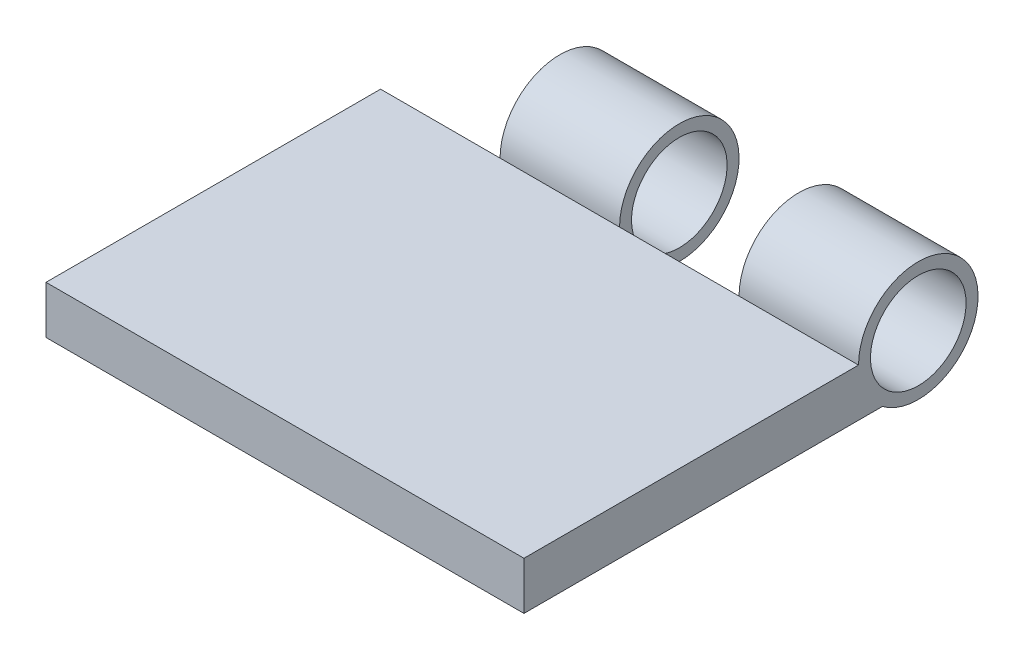
ISO-10303-21;
HEADER;
FILE_DESCRIPTION(('STEP AP214'),'2;1');
FILE_NAME('part.step','',(''),(''),'','','');
FILE_SCHEMA(('AUTOMOTIVE_DESIGN { 1 0 10303 214 1 1 1 1 }'));
ENDSEC;
DATA;
#1=APPLICATION_CONTEXT('core data for automotive mechanical design processes');
#2=APPLICATION_PROTOCOL_DEFINITION('international standard','automotive_design',2000,#1);
#3=PRODUCT_CONTEXT('',#1,'mechanical');
#4=PRODUCT('Part','Part','',(#3));
#5=PRODUCT_RELATED_PRODUCT_CATEGORY('part','',(#4));
#6=PRODUCT_DEFINITION_FORMATION('','',#4);
#7=PRODUCT_DEFINITION_CONTEXT('part definition',#1,'design');
#8=PRODUCT_DEFINITION('design','',#6,#7);
#9=PRODUCT_DEFINITION_SHAPE('','',#8);
#10=(LENGTH_UNIT() NAMED_UNIT(*) SI_UNIT(.MILLI.,.METRE.));
#11=(NAMED_UNIT(*) PLANE_ANGLE_UNIT() SI_UNIT($,.RADIAN.));
#12=(NAMED_UNIT(*) SI_UNIT($,.STERADIAN.) SOLID_ANGLE_UNIT());
#13=UNCERTAINTY_MEASURE_WITH_UNIT(LENGTH_MEASURE(1.E-05),#10,'distance_accuracy_value','');
#14=(GEOMETRIC_REPRESENTATION_CONTEXT(3) GLOBAL_UNCERTAINTY_ASSIGNED_CONTEXT((#13)) GLOBAL_UNIT_ASSIGNED_CONTEXT((#10,
#11,#12)) REPRESENTATION_CONTEXT('',''));
#15=CARTESIAN_POINT('',(0.,0.,0.));
#16=DIRECTION('',(0.,0.,1.));
#17=DIRECTION('',(1.,0.,0.));
#18=AXIS2_PLACEMENT_3D('',#15,#16,#17);
#19=CARTESIAN_POINT('',(-10.,2.,-7.));
#20=DIRECTION('',(0.,0.,1.));
#21=DIRECTION('',(1.,0.,0.));
#22=AXIS2_PLACEMENT_3D('',#19,#20,#21);
#23=PLANE('',#22);
#24=DIRECTION('',(0.,1.,0.));
#25=VECTOR('',#24,1.);
#26=CARTESIAN_POINT('',(0.,0.,-7.));
#27=LINE('',#26,#25);
#28=CARTESIAN_POINT('',(0.,0.,-7.));
#29=VERTEX_POINT('',#28);
#30=CARTESIAN_POINT('',(0.,2.,-7.));
#31=VERTEX_POINT('',#30);
#32=EDGE_CURVE('E72',#29,#31,#27,.T.);
#33=ORIENTED_EDGE('',*,*,#32,.T.);
#34=DIRECTION('',(-1.,0.,0.));
#35=VECTOR('',#34,1.);
#36=CARTESIAN_POINT('',(-10.,2.,-7.));
#37=LINE('',#36,#35);
#38=CARTESIAN_POINT('',(5.,2.,-7.));
#39=VERTEX_POINT('',#38);
#40=EDGE_CURVE('E178',#39,#31,#37,.T.);
#41=ORIENTED_EDGE('',*,*,#40,.F.);
#42=DIRECTION('',(0.,1.,0.));
#43=VECTOR('',#42,1.);
#44=CARTESIAN_POINT('',(5.,0.,-7.));
#45=LINE('',#44,#43);
#46=CARTESIAN_POINT('',(5.,0.,-7.));
#47=VERTEX_POINT('',#46);
#48=EDGE_CURVE('E160',#47,#39,#45,.T.);
#49=ORIENTED_EDGE('',*,*,#48,.F.);
#50=DIRECTION('',(-1.,0.,0.));
#51=VECTOR('',#50,1.);
#52=CARTESIAN_POINT('',(-10.,0.,-7.));
#53=LINE('',#52,#51);
#54=EDGE_CURVE('E188',#47,#29,#53,.T.);
#55=ORIENTED_EDGE('',*,*,#54,.T.);
#56=EDGE_LOOP('',(#33,#41,#49,#55));
#57=FACE_BOUND('',#56,.T.);
#58=ADVANCED_FACE('F47',(#57),#23,.F.);
#59=CARTESIAN_POINT('',(-5.,2.,-7.));
#60=VERTEX_POINT('',#59);
#61=CARTESIAN_POINT('',(-10.,2.,-7.));
#62=VERTEX_POINT('',#61);
#63=EDGE_CURVE('E64',#60,#62,#37,.T.);
#64=ORIENTED_EDGE('',*,*,#63,.F.);
#65=DIRECTION('',(0.,1.,0.));
#66=VECTOR('',#65,1.);
#67=CARTESIAN_POINT('',(-5.,0.,-7.));
#68=LINE('',#67,#66);
#69=CARTESIAN_POINT('',(-5.,0.,-7.));
#70=VERTEX_POINT('',#69);
#71=EDGE_CURVE('E377',#70,#60,#68,.T.);
#72=ORIENTED_EDGE('',*,*,#71,.F.);
#73=CARTESIAN_POINT('',(-10.,0.,-7.));
#74=VERTEX_POINT('',#73);
#75=EDGE_CURVE('E187',#70,#74,#53,.T.);
#76=ORIENTED_EDGE('',*,*,#75,.T.);
#77=DIRECTION('',(0.,-1.,0.));
#78=VECTOR('',#77,1.);
#79=CARTESIAN_POINT('',(-10.,2.,-7.));
#80=LINE('',#79,#78);
#81=EDGE_CURVE('E11',#62,#74,#80,.T.);
#82=ORIENTED_EDGE('',*,*,#81,.F.);
#83=EDGE_LOOP('',(#64,#72,#76,#82));
#84=FACE_BOUND('',#83,.T.);
#85=ADVANCED_FACE('F225',(#84),#23,.F.);
#86=CARTESIAN_POINT('',(10.,2.,7.));
#87=DIRECTION('',(-1.,0.,0.));
#88=DIRECTION('',(0.,0.,1.));
#89=AXIS2_PLACEMENT_3D('',#86,#87,#88);
#90=PLANE('',#89);
#91=CARTESIAN_POINT('',(10.,2.,-9.5));
#92=DIRECTION('',(1.,0.,0.));
#93=DIRECTION('',(0.,0.,-1.));
#94=AXIS2_PLACEMENT_3D('',#91,#92,#93);
#95=CIRCLE('',#94,2.);
#96=CARTESIAN_POINT('',(10.,2.,-11.5));
#97=VERTEX_POINT('',#96);
#98=EDGE_CURVE('E368',#97,#97,#95,.T.);
#99=ORIENTED_EDGE('',*,*,#98,.F.);
#100=EDGE_LOOP('',(#99));
#101=FACE_BOUND('',#100,.T.);
#102=DIRECTION('',(0.,0.,-1.));
#103=VECTOR('',#102,1.);
#104=CARTESIAN_POINT('',(10.,0.,7.));
#105=LINE('',#104,#103);
#106=CARTESIAN_POINT('',(10.,0.,7.));
#107=VERTEX_POINT('',#106);
#108=CARTESIAN_POINT('',(10.,0.,-8.));
#109=VERTEX_POINT('',#108);
#110=EDGE_CURVE('E168',#107,#109,#105,.T.);
#111=ORIENTED_EDGE('',*,*,#110,.T.);
#112=CARTESIAN_POINT('',(10.,2.,-9.5));
#113=DIRECTION('',(1.,0.,0.));
#114=DIRECTION('',(0.,0.,-1.));
#115=AXIS2_PLACEMENT_3D('',#112,#113,#114);
#116=CIRCLE('',#115,2.5);
#117=CARTESIAN_POINT('',(10.,2.,-7.));
#118=VERTEX_POINT('',#117);
#119=EDGE_CURVE('E142',#109,#118,#116,.T.);
#120=ORIENTED_EDGE('',*,*,#119,.T.);
#121=DIRECTION('',(0.,0.,-1.));
#122=VECTOR('',#121,1.);
#123=CARTESIAN_POINT('',(10.,2.,7.));
#124=LINE('',#123,#122);
#125=CARTESIAN_POINT('',(10.,2.,7.));
#126=VERTEX_POINT('',#125);
#127=EDGE_CURVE('E169',#126,#118,#124,.T.);
#128=ORIENTED_EDGE('',*,*,#127,.F.);
#129=DIRECTION('',(0.,-1.,0.));
#130=VECTOR('',#129,1.);
#131=CARTESIAN_POINT('',(10.,2.,7.));
#132=LINE('',#131,#130);
#133=EDGE_CURVE('E184',#126,#107,#132,.T.);
#134=ORIENTED_EDGE('',*,*,#133,.T.);
#135=EDGE_LOOP('',(#111,#120,#128,#134));
#136=FACE_BOUND('',#135,.T.);
#137=ADVANCED_FACE('F49',(#101,#136),#90,.F.);
#138=CARTESIAN_POINT('',(-10.,2.,7.));
#139=DIRECTION('',(1.,0.,0.));
#140=DIRECTION('',(0.,0.,-1.));
#141=AXIS2_PLACEMENT_3D('',#138,#139,#140);
#142=PLANE('',#141);
#143=DIRECTION('',(0.,0.,1.));
#144=VECTOR('',#143,1.);
#145=CARTESIAN_POINT('',(-10.,0.,7.));
#146=LINE('',#145,#144);
#147=CARTESIAN_POINT('',(-10.,0.,7.));
#148=VERTEX_POINT('',#147);
#149=EDGE_CURVE('E191',#74,#148,#146,.T.);
#150=ORIENTED_EDGE('',*,*,#149,.T.);
#151=DIRECTION('',(0.,-1.,0.));
#152=VECTOR('',#151,1.);
#153=CARTESIAN_POINT('',(-10.,2.,7.));
#154=LINE('',#153,#152);
#155=CARTESIAN_POINT('',(-10.,2.,7.));
#156=VERTEX_POINT('',#155);
#157=EDGE_CURVE('E57',#156,#148,#154,.T.);
#158=ORIENTED_EDGE('',*,*,#157,.F.);
#159=DIRECTION('',(0.,0.,1.));
#160=VECTOR('',#159,1.);
#161=CARTESIAN_POINT('',(-10.,2.,7.));
#162=LINE('',#161,#160);
#163=EDGE_CURVE('E177',#62,#156,#162,.T.);
#164=ORIENTED_EDGE('',*,*,#163,.F.);
#165=ORIENTED_EDGE('',*,*,#81,.T.);
#166=EDGE_LOOP('',(#150,#158,#164,#165));
#167=FACE_BOUND('',#166,.T.);
#168=ADVANCED_FACE('F226',(#167),#142,.F.);
#169=CARTESIAN_POINT('',(-10.,2.,7.));
#170=DIRECTION('',(0.,0.,-1.));
#171=DIRECTION('',(-1.,0.,0.));
#172=AXIS2_PLACEMENT_3D('',#169,#170,#171);
#173=PLANE('',#172);
#174=DIRECTION('',(1.,0.,0.));
#175=VECTOR('',#174,1.);
#176=CARTESIAN_POINT('',(-10.,0.,7.));
#177=LINE('',#176,#175);
#178=EDGE_CURVE('E172',#148,#107,#177,.T.);
#179=ORIENTED_EDGE('',*,*,#178,.T.);
#180=ORIENTED_EDGE('',*,*,#133,.F.);
#181=DIRECTION('',(1.,0.,0.));
#182=VECTOR('',#181,1.);
#183=CARTESIAN_POINT('',(-10.,2.,7.));
#184=LINE('',#183,#182);
#185=EDGE_CURVE('E181',#156,#126,#184,.T.);
#186=ORIENTED_EDGE('',*,*,#185,.F.);
#187=ORIENTED_EDGE('',*,*,#157,.T.);
#188=EDGE_LOOP('',(#179,#180,#186,#187));
#189=FACE_BOUND('',#188,.T.);
#190=ADVANCED_FACE('F205',(#189),#173,.F.);
#191=CARTESIAN_POINT('',(0.,2.,0.));
#192=DIRECTION('',(0.,-1.,0.));
#193=DIRECTION('',(0.,0.,-1.));
#194=AXIS2_PLACEMENT_3D('',#191,#192,#193);
#195=PLANE('',#194);
#196=ORIENTED_EDGE('',*,*,#127,.T.);
#197=EDGE_CURVE('E173',#118,#39,#37,.T.);
#198=ORIENTED_EDGE('',*,*,#197,.T.);
#199=ORIENTED_EDGE('',*,*,#40,.T.);
#200=DIRECTION('',(-1.,0.,0.));
#201=VECTOR('',#200,1.);
#202=CARTESIAN_POINT('',(0.,2.,-7.));
#203=LINE('',#202,#201);
#204=EDGE_CURVE('E126',#31,#60,#203,.T.);
#205=ORIENTED_EDGE('',*,*,#204,.T.);
#206=ORIENTED_EDGE('',*,*,#63,.T.);
#207=ORIENTED_EDGE('',*,*,#163,.T.);
#208=ORIENTED_EDGE('',*,*,#185,.T.);
#209=EDGE_LOOP('',(#196,#198,#199,#205,#206,#207,#208));
#210=FACE_BOUND('',#209,.T.);
#211=ADVANCED_FACE('F215',(#210),#195,.F.);
#212=CARTESIAN_POINT('',(0.,0.,0.));
#213=DIRECTION('',(0.,-1.,0.));
#214=DIRECTION('',(0.,0.,-1.));
#215=AXIS2_PLACEMENT_3D('',#212,#213,#214);
#216=PLANE('',#215);
#217=ORIENTED_EDGE('',*,*,#110,.F.);
#218=ORIENTED_EDGE('',*,*,#178,.F.);
#219=ORIENTED_EDGE('',*,*,#149,.F.);
#220=ORIENTED_EDGE('',*,*,#75,.F.);
#221=DIRECTION('',(0.,0.,-1.));
#222=VECTOR('',#221,1.);
#223=CARTESIAN_POINT('',(-5.,0.,0.));
#224=LINE('',#223,#222);
#225=CARTESIAN_POINT('',(-5.,0.,-8.));
#226=VERTEX_POINT('',#225);
#227=EDGE_CURVE('E140',#70,#226,#224,.T.);
#228=ORIENTED_EDGE('',*,*,#227,.T.);
#229=DIRECTION('',(-1.,0.,0.));
#230=VECTOR('',#229,1.);
#231=CARTESIAN_POINT('',(0.,0.,-8.));
#232=LINE('',#231,#230);
#233=CARTESIAN_POINT('',(0.,0.,-8.));
#234=VERTEX_POINT('',#233);
#235=EDGE_CURVE('E124',#234,#226,#232,.T.);
#236=ORIENTED_EDGE('',*,*,#235,.F.);
#237=DIRECTION('',(0.,0.,-1.));
#238=VECTOR('',#237,1.);
#239=CARTESIAN_POINT('',(0.,0.,0.));
#240=LINE('',#239,#238);
#241=EDGE_CURVE('E131',#29,#234,#240,.T.);
#242=ORIENTED_EDGE('',*,*,#241,.F.);
#243=ORIENTED_EDGE('',*,*,#54,.F.);
#244=DIRECTION('',(0.,0.,-1.));
#245=VECTOR('',#244,1.);
#246=CARTESIAN_POINT('',(5.,0.,0.));
#247=LINE('',#246,#245);
#248=CARTESIAN_POINT('',(5.,0.,-8.));
#249=VERTEX_POINT('',#248);
#250=EDGE_CURVE('E147',#47,#249,#247,.T.);
#251=ORIENTED_EDGE('',*,*,#250,.T.);
#252=DIRECTION('',(1.,0.,0.));
#253=VECTOR('',#252,1.);
#254=CARTESIAN_POINT('',(5.,0.,-8.));
#255=LINE('',#254,#253);
#256=EDGE_CURVE('E163',#249,#109,#255,.T.);
#257=ORIENTED_EDGE('',*,*,#256,.T.);
#258=EDGE_LOOP('',(#217,#218,#219,#220,#228,#236,#242,#243,#251,#257));
#259=FACE_BOUND('',#258,.T.);
#260=ADVANCED_FACE('F138',(#259),#216,.T.);
#261=CARTESIAN_POINT('',(5.,2.,-9.5));
#262=DIRECTION('',(1.,0.,0.));
#263=DIRECTION('',(0.,0.,-1.));
#264=AXIS2_PLACEMENT_3D('',#261,#262,#263);
#265=CYLINDRICAL_SURFACE('',#264,2.5);
#266=ORIENTED_EDGE('',*,*,#119,.F.);
#267=ORIENTED_EDGE('',*,*,#256,.F.);
#268=CARTESIAN_POINT('',(5.,2.,-9.5));
#269=DIRECTION('',(1.,0.,0.));
#270=DIRECTION('',(0.,0.,-1.));
#271=AXIS2_PLACEMENT_3D('',#268,#269,#270);
#272=CIRCLE('',#271,2.5);
#273=EDGE_CURVE('E156',#249,#39,#272,.T.);
#274=ORIENTED_EDGE('',*,*,#273,.T.);
#275=ORIENTED_EDGE('',*,*,#197,.F.);
#276=EDGE_LOOP('',(#266,#267,#274,#275));
#277=FACE_BOUND('',#276,.T.);
#278=ADVANCED_FACE('F217',(#277),#265,.T.);
#279=CARTESIAN_POINT('',(5.,0.,0.));
#280=DIRECTION('',(1.,0.,0.));
#281=DIRECTION('',(0.,0.,-1.));
#282=AXIS2_PLACEMENT_3D('',#279,#280,#281);
#283=PLANE('',#282);
#284=CARTESIAN_POINT('',(5.,2.,-9.5));
#285=DIRECTION('',(1.,0.,0.));
#286=DIRECTION('',(0.,0.,-1.));
#287=AXIS2_PLACEMENT_3D('',#284,#285,#286);
#288=CIRCLE('',#287,2.);
#289=CARTESIAN_POINT('',(5.,2.,-11.5));
#290=VERTEX_POINT('',#289);
#291=EDGE_CURVE('E371',#290,#290,#288,.T.);
#292=ORIENTED_EDGE('',*,*,#291,.T.);
#293=EDGE_LOOP('',(#292));
#294=FACE_BOUND('',#293,.T.);
#295=ORIENTED_EDGE('',*,*,#250,.F.);
#296=ORIENTED_EDGE('',*,*,#48,.T.);
#297=ORIENTED_EDGE('',*,*,#273,.F.);
#298=EDGE_LOOP('',(#295,#296,#297));
#299=FACE_BOUND('',#298,.T.);
#300=ADVANCED_FACE('F221',(#294,#299),#283,.F.);
#301=CARTESIAN_POINT('',(0.,2.,-9.5));
#302=DIRECTION('',(-1.,0.,0.));
#303=DIRECTION('',(0.,0.,1.));
#304=AXIS2_PLACEMENT_3D('',#301,#302,#303);
#305=CYLINDRICAL_SURFACE('',#304,2.5);
#306=CARTESIAN_POINT('',(-5.,2.,-9.5));
#307=DIRECTION('',(1.,0.,0.));
#308=DIRECTION('',(0.,0.,-1.));
#309=AXIS2_PLACEMENT_3D('',#306,#307,#308);
#310=CIRCLE('',#309,2.5);
#311=EDGE_CURVE('E135',#226,#60,#310,.T.);
#312=ORIENTED_EDGE('',*,*,#311,.T.);
#313=ORIENTED_EDGE('',*,*,#204,.F.);
#314=CARTESIAN_POINT('',(0.,2.,-9.5));
#315=DIRECTION('',(1.,0.,0.));
#316=DIRECTION('',(0.,0.,-1.));
#317=AXIS2_PLACEMENT_3D('',#314,#315,#316);
#318=CIRCLE('',#317,2.5);
#319=EDGE_CURVE('E119',#234,#31,#318,.T.);
#320=ORIENTED_EDGE('',*,*,#319,.F.);
#321=ORIENTED_EDGE('',*,*,#235,.T.);
#322=EDGE_LOOP('',(#312,#313,#320,#321));
#323=FACE_BOUND('',#322,.T.);
#324=ADVANCED_FACE('F122',(#323),#305,.T.);
#325=CARTESIAN_POINT('',(0.,0.,0.));
#326=DIRECTION('',(-1.,0.,0.));
#327=DIRECTION('',(0.,0.,-1.));
#328=AXIS2_PLACEMENT_3D('',#325,#326,#327);
#329=PLANE('',#328);
#330=CARTESIAN_POINT('',(0.,2.,-9.5));
#331=DIRECTION('',(-1.,0.,0.));
#332=DIRECTION('',(0.,0.,1.));
#333=AXIS2_PLACEMENT_3D('',#330,#331,#332);
#334=CIRCLE('',#333,2.);
#335=CARTESIAN_POINT('',(0.,2.,-7.5));
#336=VERTEX_POINT('',#335);
#337=EDGE_CURVE('E373',#336,#336,#334,.T.);
#338=ORIENTED_EDGE('',*,*,#337,.T.);
#339=EDGE_LOOP('',(#338));
#340=FACE_BOUND('',#339,.T.);
#341=ORIENTED_EDGE('',*,*,#241,.T.);
#342=ORIENTED_EDGE('',*,*,#319,.T.);
#343=ORIENTED_EDGE('',*,*,#32,.F.);
#344=EDGE_LOOP('',(#341,#342,#343));
#345=FACE_BOUND('',#344,.T.);
#346=ADVANCED_FACE('F132',(#340,#345),#329,.F.);
#347=CARTESIAN_POINT('',(-5.,0.,0.));
#348=DIRECTION('',(-1.,0.,0.));
#349=DIRECTION('',(0.,0.,-1.));
#350=AXIS2_PLACEMENT_3D('',#347,#348,#349);
#351=PLANE('',#350);
#352=CARTESIAN_POINT('',(-5.,2.,-9.5));
#353=DIRECTION('',(-1.,0.,0.));
#354=DIRECTION('',(0.,0.,1.));
#355=AXIS2_PLACEMENT_3D('',#352,#353,#354);
#356=CIRCLE('',#355,2.);
#357=CARTESIAN_POINT('',(-5.,2.,-7.5));
#358=VERTEX_POINT('',#357);
#359=EDGE_CURVE('E51',#358,#358,#356,.T.);
#360=ORIENTED_EDGE('',*,*,#359,.F.);
#361=EDGE_LOOP('',(#360));
#362=FACE_BOUND('',#361,.T.);
#363=ORIENTED_EDGE('',*,*,#227,.F.);
#364=ORIENTED_EDGE('',*,*,#71,.T.);
#365=ORIENTED_EDGE('',*,*,#311,.F.);
#366=EDGE_LOOP('',(#363,#364,#365));
#367=FACE_BOUND('',#366,.T.);
#368=ADVANCED_FACE('F288',(#362,#367),#351,.T.);
#369=CARTESIAN_POINT('',(-10.,2.,-9.5));
#370=DIRECTION('',(1.,0.,0.));
#371=DIRECTION('',(0.,0.,-1.));
#372=AXIS2_PLACEMENT_3D('',#369,#370,#371);
#373=CYLINDRICAL_SURFACE('',#372,2.);
#374=ORIENTED_EDGE('',*,*,#359,.T.);
#375=EDGE_LOOP('',(#374));
#376=FACE_BOUND('',#375,.T.);
#377=ORIENTED_EDGE('',*,*,#337,.F.);
#378=EDGE_LOOP('',(#377));
#379=FACE_BOUND('',#378,.T.);
#380=ADVANCED_FACE('F297',(#376,#379),#373,.F.);
#381=ORIENTED_EDGE('',*,*,#98,.T.);
#382=EDGE_LOOP('',(#381));
#383=FACE_BOUND('',#382,.T.);
#384=ORIENTED_EDGE('',*,*,#291,.F.);
#385=EDGE_LOOP('',(#384));
#386=FACE_BOUND('',#385,.T.);
#387=ADVANCED_FACE('F305',(#383,#386),#373,.F.);
#388=CLOSED_SHELL('',(#58,#85,#137,#168,#190,#211,#260,#278,#300,#324,#346,#368,#380,#387));
#389=MANIFOLD_SOLID_BREP('B2',#388);
#390=ADVANCED_BREP_SHAPE_REPRESENTATION('',(#18,#389),#14);
#391=SHAPE_DEFINITION_REPRESENTATION(#9,#390);
ENDSEC;
END-ISO-10303-21;
